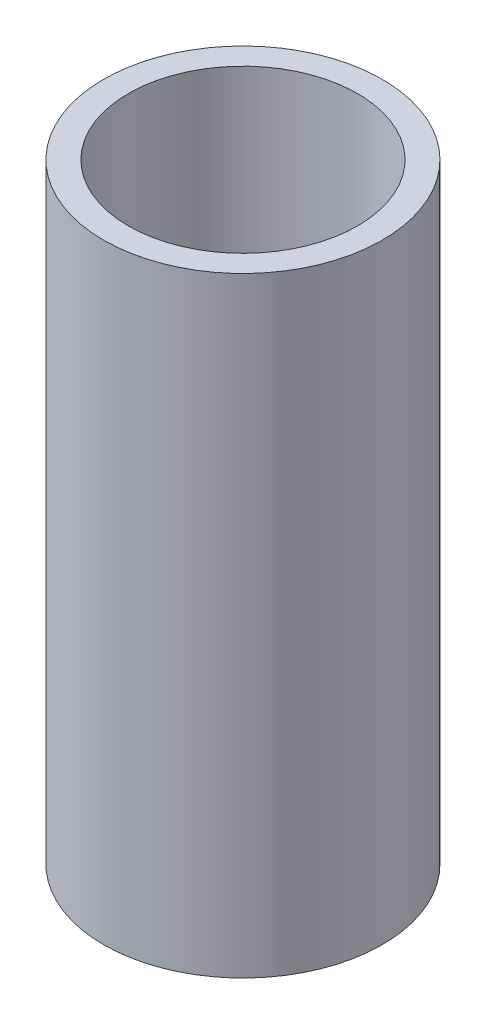
ISO-10303-21;
HEADER;
FILE_DESCRIPTION(('STEP AP214'),'2;1');
FILE_NAME('part.step','',(''),(''),'','','');
FILE_SCHEMA(('AUTOMOTIVE_DESIGN { 1 0 10303 214 1 1 1 1 }'));
ENDSEC;
DATA;
#1=APPLICATION_CONTEXT('core data for automotive mechanical design processes');
#2=APPLICATION_PROTOCOL_DEFINITION('international standard','automotive_design',2000,#1);
#3=PRODUCT_CONTEXT('',#1,'mechanical');
#4=PRODUCT('Part','Part','',(#3));
#5=PRODUCT_RELATED_PRODUCT_CATEGORY('part','',(#4));
#6=PRODUCT_DEFINITION_FORMATION('','',#4);
#7=PRODUCT_DEFINITION_CONTEXT('part definition',#1,'design');
#8=PRODUCT_DEFINITION('design','',#6,#7);
#9=PRODUCT_DEFINITION_SHAPE('','',#8);
#10=(LENGTH_UNIT() NAMED_UNIT(*) SI_UNIT(.MILLI.,.METRE.));
#11=(NAMED_UNIT(*) PLANE_ANGLE_UNIT() SI_UNIT($,.RADIAN.));
#12=(NAMED_UNIT(*) SI_UNIT($,.STERADIAN.) SOLID_ANGLE_UNIT());
#13=UNCERTAINTY_MEASURE_WITH_UNIT(LENGTH_MEASURE(1.E-05),#10,'distance_accuracy_value','');
#14=(GEOMETRIC_REPRESENTATION_CONTEXT(3) GLOBAL_UNCERTAINTY_ASSIGNED_CONTEXT((#13)) GLOBAL_UNIT_ASSIGNED_CONTEXT((#10,
#11,#12)) REPRESENTATION_CONTEXT('',''));
#15=CARTESIAN_POINT('',(0.,0.,0.));
#16=DIRECTION('',(0.,0.,1.));
#17=DIRECTION('',(1.,0.,0.));
#18=AXIS2_PLACEMENT_3D('',#15,#16,#17);
#19=CARTESIAN_POINT('',(0.,173.,0.));
#20=DIRECTION('',(0.,-1.,0.));
#21=DIRECTION('',(0.,0.,-1.));
#22=AXIS2_PLACEMENT_3D('',#19,#20,#21);
#23=CYLINDRICAL_SURFACE('',#22,39.5);
#24=CARTESIAN_POINT('',(0.,173.,0.));
#25=DIRECTION('',(0.,1.,0.));
#26=DIRECTION('',(0.,0.,1.));
#27=AXIS2_PLACEMENT_3D('',#24,#25,#26);
#28=CIRCLE('',#27,39.5);
#29=CARTESIAN_POINT('',(0.,173.,39.5));
#30=VERTEX_POINT('',#29);
#31=EDGE_CURVE('E10',#30,#30,#28,.T.);
#32=ORIENTED_EDGE('',*,*,#31,.F.);
#33=EDGE_LOOP('',(#32));
#34=FACE_BOUND('',#33,.T.);
#35=CARTESIAN_POINT('',(0.,0.,0.));
#36=DIRECTION('',(0.,1.,0.));
#37=DIRECTION('',(0.,0.,1.));
#38=AXIS2_PLACEMENT_3D('',#35,#36,#37);
#39=CIRCLE('',#38,39.5);
#40=CARTESIAN_POINT('',(0.,0.,39.5));
#41=VERTEX_POINT('',#40);
#42=EDGE_CURVE('E33',#41,#41,#39,.T.);
#43=ORIENTED_EDGE('',*,*,#42,.T.);
#44=EDGE_LOOP('',(#43));
#45=FACE_BOUND('',#44,.T.);
#46=ADVANCED_FACE('F30',(#34,#45),#23,.T.);
#47=CARTESIAN_POINT('',(0.,173.,0.));
#48=DIRECTION('',(0.,1.,0.));
#49=DIRECTION('',(0.,0.,1.));
#50=AXIS2_PLACEMENT_3D('',#47,#48,#49);
#51=PLANE('',#50);
#52=CARTESIAN_POINT('',(0.,173.,0.));
#53=DIRECTION('',(0.,1.,0.));
#54=DIRECTION('',(0.,0.,1.));
#55=AXIS2_PLACEMENT_3D('',#52,#53,#54);
#56=CIRCLE('',#55,32.5);
#57=CARTESIAN_POINT('',(0.,173.,32.5));
#58=VERTEX_POINT('',#57);
#59=EDGE_CURVE('E42',#58,#58,#56,.T.);
#60=ORIENTED_EDGE('',*,*,#59,.F.);
#61=EDGE_LOOP('',(#60));
#62=FACE_BOUND('',#61,.T.);
#63=ORIENTED_EDGE('',*,*,#31,.T.);
#64=EDGE_LOOP('',(#63));
#65=FACE_BOUND('',#64,.T.);
#66=ADVANCED_FACE('F57',(#62,#65),#51,.T.);
#67=CARTESIAN_POINT('',(0.,0.,0.));
#68=DIRECTION('',(0.,1.,0.));
#69=DIRECTION('',(0.,0.,1.));
#70=AXIS2_PLACEMENT_3D('',#67,#68,#69);
#71=PLANE('',#70);
#72=ORIENTED_EDGE('',*,*,#42,.F.);
#73=EDGE_LOOP('',(#72));
#74=FACE_BOUND('',#73,.T.);
#75=ADVANCED_FACE('F53',(#74),#71,.F.);
#76=CARTESIAN_POINT('',(0.,48.,0.));
#77=DIRECTION('',(0.,1.,0.));
#78=DIRECTION('',(0.,0.,1.));
#79=AXIS2_PLACEMENT_3D('',#76,#77,#78);
#80=CYLINDRICAL_SURFACE('',#79,32.5);
#81=CARTESIAN_POINT('',(0.,48.,0.));
#82=DIRECTION('',(0.,1.,0.));
#83=DIRECTION('',(0.,0.,1.));
#84=AXIS2_PLACEMENT_3D('',#81,#82,#83);
#85=CIRCLE('',#84,32.5);
#86=CARTESIAN_POINT('',(0.,48.,32.5));
#87=VERTEX_POINT('',#86);
#88=EDGE_CURVE('E40',#87,#87,#85,.T.);
#89=ORIENTED_EDGE('',*,*,#88,.F.);
#90=EDGE_LOOP('',(#89));
#91=FACE_BOUND('',#90,.T.);
#92=ORIENTED_EDGE('',*,*,#59,.T.);
#93=EDGE_LOOP('',(#92));
#94=FACE_BOUND('',#93,.T.);
#95=ADVANCED_FACE('F50',(#91,#94),#80,.F.);
#96=CARTESIAN_POINT('',(0.,48.,0.));
#97=DIRECTION('',(0.,1.,0.));
#98=DIRECTION('',(0.,0.,1.));
#99=AXIS2_PLACEMENT_3D('',#96,#97,#98);
#100=PLANE('',#99);
#101=ORIENTED_EDGE('',*,*,#88,.T.);
#102=EDGE_LOOP('',(#101));
#103=FACE_BOUND('',#102,.T.);
#104=ADVANCED_FACE('F48',(#103),#100,.T.);
#105=CLOSED_SHELL('',(#46,#66,#75,#95,#104));
#106=MANIFOLD_SOLID_BREP('B2',#105);
#107=ADVANCED_BREP_SHAPE_REPRESENTATION('',(#18,#106),#14);
#108=SHAPE_DEFINITION_REPRESENTATION(#9,#107);
ENDSEC;
END-ISO-10303-21;
